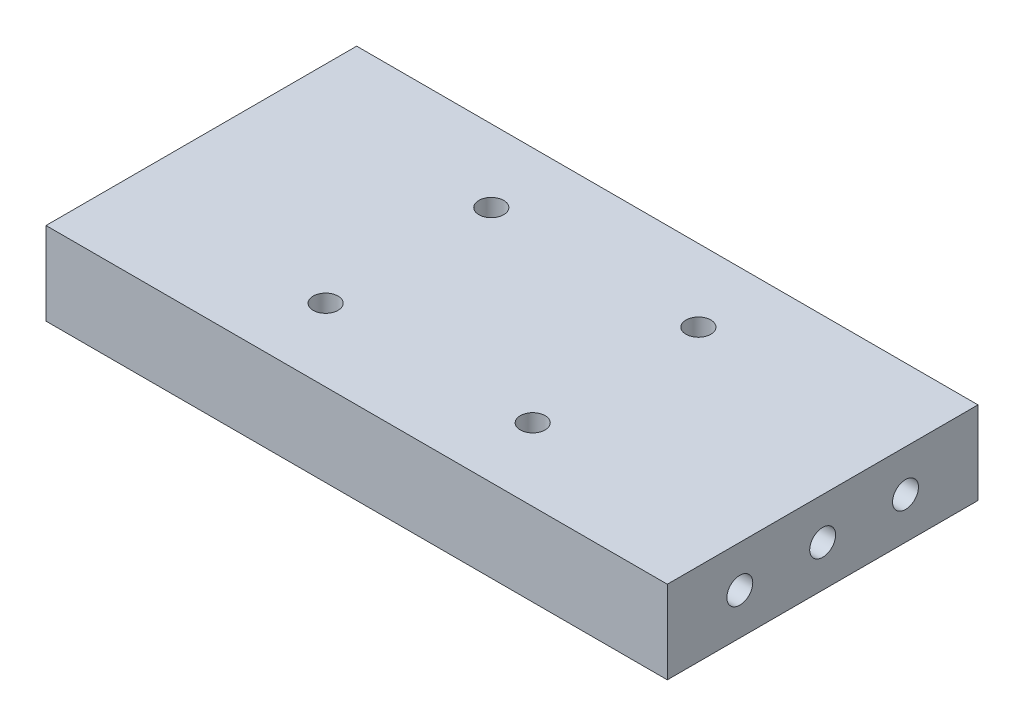
ISO-10303-21;
HEADER;
FILE_DESCRIPTION(('STEP AP214'),'2;1');
FILE_NAME('part.step','',(''),(''),'','','');
FILE_SCHEMA(('AUTOMOTIVE_DESIGN { 1 0 10303 214 1 1 1 1 }'));
ENDSEC;
DATA;
#1=APPLICATION_CONTEXT('core data for automotive mechanical design processes');
#2=APPLICATION_PROTOCOL_DEFINITION('international standard','automotive_design',2000,#1);
#3=PRODUCT_CONTEXT('',#1,'mechanical');
#4=PRODUCT('Part','Part','',(#3));
#5=PRODUCT_RELATED_PRODUCT_CATEGORY('part','',(#4));
#6=PRODUCT_DEFINITION_FORMATION('','',#4);
#7=PRODUCT_DEFINITION_CONTEXT('part definition',#1,'design');
#8=PRODUCT_DEFINITION('design','',#6,#7);
#9=PRODUCT_DEFINITION_SHAPE('','',#8);
#10=(LENGTH_UNIT() NAMED_UNIT(*) SI_UNIT(.MILLI.,.METRE.));
#11=(NAMED_UNIT(*) PLANE_ANGLE_UNIT() SI_UNIT($,.RADIAN.));
#12=(NAMED_UNIT(*) SI_UNIT($,.STERADIAN.) SOLID_ANGLE_UNIT());
#13=UNCERTAINTY_MEASURE_WITH_UNIT(LENGTH_MEASURE(1.E-05),#10,'distance_accuracy_value','');
#14=(GEOMETRIC_REPRESENTATION_CONTEXT(3) GLOBAL_UNCERTAINTY_ASSIGNED_CONTEXT((#13)) GLOBAL_UNIT_ASSIGNED_CONTEXT((#10,
#11,#12)) REPRESENTATION_CONTEXT('',''));
#15=CARTESIAN_POINT('',(0.,0.,0.));
#16=DIRECTION('',(0.,0.,1.));
#17=DIRECTION('',(1.,0.,0.));
#18=AXIS2_PLACEMENT_3D('',#15,#16,#17);
#19=CARTESIAN_POINT('',(30.,8.,-15.));
#20=DIRECTION('',(-1.,0.,0.));
#21=DIRECTION('',(0.,0.,1.));
#22=AXIS2_PLACEMENT_3D('',#19,#20,#21);
#23=PLANE('',#22);
#24=CARTESIAN_POINT('',(30.,4.,8.));
#25=DIRECTION('',(1.,0.,0.));
#26=DIRECTION('',(0.,0.,-1.));
#27=AXIS2_PLACEMENT_3D('',#24,#25,#26);
#28=CIRCLE('',#27,1.24999999999999);
#29=CARTESIAN_POINT('',(30.,4.,6.75000000000001));
#30=VERTEX_POINT('',#29);
#31=EDGE_CURVE('E114',#30,#30,#28,.T.);
#32=ORIENTED_EDGE('',*,*,#31,.F.);
#33=EDGE_LOOP('',(#32));
#34=FACE_BOUND('',#33,.T.);
#35=CARTESIAN_POINT('',(30.,4.,0.));
#36=DIRECTION('',(1.,0.,0.));
#37=DIRECTION('',(0.,0.,-1.));
#38=AXIS2_PLACEMENT_3D('',#35,#36,#37);
#39=CIRCLE('',#38,1.24999999999999);
#40=CARTESIAN_POINT('',(30.,4.,-1.24999999999999));
#41=VERTEX_POINT('',#40);
#42=EDGE_CURVE('E113',#41,#41,#39,.T.);
#43=ORIENTED_EDGE('',*,*,#42,.F.);
#44=EDGE_LOOP('',(#43));
#45=FACE_BOUND('',#44,.T.);
#46=CARTESIAN_POINT('',(30.,4.,-8.));
#47=DIRECTION('',(1.,0.,0.));
#48=DIRECTION('',(0.,0.,-1.));
#49=AXIS2_PLACEMENT_3D('',#46,#47,#48);
#50=CIRCLE('',#49,1.24999999999999);
#51=CARTESIAN_POINT('',(30.,4.,-9.24999999999999));
#52=VERTEX_POINT('',#51);
#53=EDGE_CURVE('E124',#52,#52,#50,.T.);
#54=ORIENTED_EDGE('',*,*,#53,.F.);
#55=EDGE_LOOP('',(#54));
#56=FACE_BOUND('',#55,.T.);
#57=DIRECTION('',(0.,0.,-1.));
#58=VECTOR('',#57,1.);
#59=CARTESIAN_POINT('',(30.,0.,-15.));
#60=LINE('',#59,#58);
#61=CARTESIAN_POINT('',(30.,0.,15.));
#62=VERTEX_POINT('',#61);
#63=CARTESIAN_POINT('',(30.,0.,-15.));
#64=VERTEX_POINT('',#63);
#65=EDGE_CURVE('E172',#62,#64,#60,.T.);
#66=ORIENTED_EDGE('',*,*,#65,.T.);
#67=DIRECTION('',(0.,-1.,0.));
#68=VECTOR('',#67,1.);
#69=CARTESIAN_POINT('',(30.,8.,-15.));
#70=LINE('',#69,#68);
#71=CARTESIAN_POINT('',(30.,8.,-15.));
#72=VERTEX_POINT('',#71);
#73=EDGE_CURVE('E11',#72,#64,#70,.T.);
#74=ORIENTED_EDGE('',*,*,#73,.F.);
#75=DIRECTION('',(0.,0.,-1.));
#76=VECTOR('',#75,1.);
#77=CARTESIAN_POINT('',(30.,8.,-15.));
#78=LINE('',#77,#76);
#79=CARTESIAN_POINT('',(30.,8.,15.));
#80=VERTEX_POINT('',#79);
#81=EDGE_CURVE('E173',#80,#72,#78,.T.);
#82=ORIENTED_EDGE('',*,*,#81,.F.);
#83=DIRECTION('',(0.,-1.,0.));
#84=VECTOR('',#83,1.);
#85=CARTESIAN_POINT('',(30.,8.,15.));
#86=LINE('',#85,#84);
#87=EDGE_CURVE('E179',#80,#62,#86,.T.);
#88=ORIENTED_EDGE('',*,*,#87,.T.);
#89=EDGE_LOOP('',(#66,#74,#82,#88));
#90=FACE_BOUND('',#89,.T.);
#91=ADVANCED_FACE('F37',(#34,#45,#56,#90),#23,.F.);
#92=CARTESIAN_POINT('',(-30.,8.,-15.));
#93=DIRECTION('',(0.,0.,1.));
#94=DIRECTION('',(1.,0.,0.));
#95=AXIS2_PLACEMENT_3D('',#92,#93,#94);
#96=PLANE('',#95);
#97=DIRECTION('',(-1.,0.,0.));
#98=VECTOR('',#97,1.);
#99=CARTESIAN_POINT('',(-30.,0.,-15.));
#100=LINE('',#99,#98);
#101=CARTESIAN_POINT('',(-30.,0.,-15.));
#102=VERTEX_POINT('',#101);
#103=EDGE_CURVE('E182',#64,#102,#100,.T.);
#104=ORIENTED_EDGE('',*,*,#103,.T.);
#105=DIRECTION('',(0.,-1.,0.));
#106=VECTOR('',#105,1.);
#107=CARTESIAN_POINT('',(-30.,8.,-15.));
#108=LINE('',#107,#106);
#109=CARTESIAN_POINT('',(-30.,8.,-15.));
#110=VERTEX_POINT('',#109);
#111=EDGE_CURVE('E45',#110,#102,#108,.T.);
#112=ORIENTED_EDGE('',*,*,#111,.F.);
#113=DIRECTION('',(-1.,0.,0.));
#114=VECTOR('',#113,1.);
#115=CARTESIAN_POINT('',(-30.,8.,-15.));
#116=LINE('',#115,#114);
#117=EDGE_CURVE('E84',#72,#110,#116,.T.);
#118=ORIENTED_EDGE('',*,*,#117,.F.);
#119=ORIENTED_EDGE('',*,*,#73,.T.);
#120=EDGE_LOOP('',(#104,#112,#118,#119));
#121=FACE_BOUND('',#120,.T.);
#122=ADVANCED_FACE('F206',(#121),#96,.F.);
#123=CARTESIAN_POINT('',(-30.,8.,-15.));
#124=DIRECTION('',(1.,0.,0.));
#125=DIRECTION('',(0.,0.,-1.));
#126=AXIS2_PLACEMENT_3D('',#123,#124,#125);
#127=PLANE('',#126);
#128=CARTESIAN_POINT('',(-30.,4.,-8.));
#129=DIRECTION('',(-1.,0.,0.));
#130=DIRECTION('',(0.,0.,1.));
#131=AXIS2_PLACEMENT_3D('',#128,#129,#130);
#132=CIRCLE('',#131,1.25);
#133=CARTESIAN_POINT('',(-30.,4.,-6.75));
#134=VERTEX_POINT('',#133);
#135=EDGE_CURVE('E130',#134,#134,#132,.T.);
#136=ORIENTED_EDGE('',*,*,#135,.F.);
#137=EDGE_LOOP('',(#136));
#138=FACE_BOUND('',#137,.T.);
#139=CARTESIAN_POINT('',(-30.,4.,0.));
#140=DIRECTION('',(-1.,0.,0.));
#141=DIRECTION('',(0.,0.,1.));
#142=AXIS2_PLACEMENT_3D('',#139,#140,#141);
#143=CIRCLE('',#142,1.25);
#144=CARTESIAN_POINT('',(-30.,4.,1.25));
#145=VERTEX_POINT('',#144);
#146=EDGE_CURVE('E136',#145,#145,#143,.T.);
#147=ORIENTED_EDGE('',*,*,#146,.F.);
#148=EDGE_LOOP('',(#147));
#149=FACE_BOUND('',#148,.T.);
#150=CARTESIAN_POINT('',(-30.,4.,8.));
#151=DIRECTION('',(-1.,0.,0.));
#152=DIRECTION('',(0.,0.,1.));
#153=AXIS2_PLACEMENT_3D('',#150,#151,#152);
#154=CIRCLE('',#153,1.25);
#155=CARTESIAN_POINT('',(-30.,4.,9.25));
#156=VERTEX_POINT('',#155);
#157=EDGE_CURVE('E142',#156,#156,#154,.T.);
#158=ORIENTED_EDGE('',*,*,#157,.F.);
#159=EDGE_LOOP('',(#158));
#160=FACE_BOUND('',#159,.T.);
#161=DIRECTION('',(0.,0.,1.));
#162=VECTOR('',#161,1.);
#163=CARTESIAN_POINT('',(-30.,0.,-15.));
#164=LINE('',#163,#162);
#165=CARTESIAN_POINT('',(-30.,0.,15.));
#166=VERTEX_POINT('',#165);
#167=EDGE_CURVE('E71',#102,#166,#164,.T.);
#168=ORIENTED_EDGE('',*,*,#167,.T.);
#169=DIRECTION('',(0.,-1.,0.));
#170=VECTOR('',#169,1.);
#171=CARTESIAN_POINT('',(-30.,8.,15.));
#172=LINE('',#171,#170);
#173=CARTESIAN_POINT('',(-30.,8.,15.));
#174=VERTEX_POINT('',#173);
#175=EDGE_CURVE('E187',#174,#166,#172,.T.);
#176=ORIENTED_EDGE('',*,*,#175,.F.);
#177=DIRECTION('',(0.,0.,1.));
#178=VECTOR('',#177,1.);
#179=CARTESIAN_POINT('',(-30.,8.,-15.));
#180=LINE('',#179,#178);
#181=EDGE_CURVE('E176',#110,#174,#180,.T.);
#182=ORIENTED_EDGE('',*,*,#181,.F.);
#183=ORIENTED_EDGE('',*,*,#111,.T.);
#184=EDGE_LOOP('',(#168,#176,#182,#183));
#185=FACE_BOUND('',#184,.T.);
#186=ADVANCED_FACE('F189',(#138,#149,#160,#185),#127,.F.);
#187=CARTESIAN_POINT('',(-30.,8.,15.));
#188=DIRECTION('',(0.,0.,-1.));
#189=DIRECTION('',(-1.,0.,0.));
#190=AXIS2_PLACEMENT_3D('',#187,#188,#189);
#191=PLANE('',#190);
#192=DIRECTION('',(1.,0.,0.));
#193=VECTOR('',#192,1.);
#194=CARTESIAN_POINT('',(-30.,0.,15.));
#195=LINE('',#194,#193);
#196=EDGE_CURVE('E77',#166,#62,#195,.T.);
#197=ORIENTED_EDGE('',*,*,#196,.T.);
#198=ORIENTED_EDGE('',*,*,#87,.F.);
#199=DIRECTION('',(1.,0.,0.));
#200=VECTOR('',#199,1.);
#201=CARTESIAN_POINT('',(-30.,8.,15.));
#202=LINE('',#201,#200);
#203=EDGE_CURVE('E53',#174,#80,#202,.T.);
#204=ORIENTED_EDGE('',*,*,#203,.F.);
#205=ORIENTED_EDGE('',*,*,#175,.T.);
#206=EDGE_LOOP('',(#197,#198,#204,#205));
#207=FACE_BOUND('',#206,.T.);
#208=ADVANCED_FACE('F196',(#207),#191,.F.);
#209=CARTESIAN_POINT('',(0.,8.,0.));
#210=DIRECTION('',(0.,1.,0.));
#211=DIRECTION('',(0.,0.,1.));
#212=AXIS2_PLACEMENT_3D('',#209,#210,#211);
#213=PLANE('',#212);
#214=CARTESIAN_POINT('',(-10.,8.,8.));
#215=DIRECTION('',(0.,1.,0.));
#216=DIRECTION('',(0.,0.,-1.));
#217=AXIS2_PLACEMENT_3D('',#214,#215,#216);
#218=CIRCLE('',#217,1.2);
#219=CARTESIAN_POINT('',(-10.,8.,6.8));
#220=VERTEX_POINT('',#219);
#221=EDGE_CURVE('E148',#220,#220,#218,.T.);
#222=ORIENTED_EDGE('',*,*,#221,.F.);
#223=EDGE_LOOP('',(#222));
#224=FACE_BOUND('',#223,.T.);
#225=CARTESIAN_POINT('',(10.,8.,8.));
#226=DIRECTION('',(0.,1.,0.));
#227=DIRECTION('',(0.,0.,1.));
#228=AXIS2_PLACEMENT_3D('',#225,#226,#227);
#229=CIRCLE('',#228,1.2);
#230=CARTESIAN_POINT('',(10.,8.,9.2));
#231=VERTEX_POINT('',#230);
#232=EDGE_CURVE('E157',#231,#231,#229,.T.);
#233=ORIENTED_EDGE('',*,*,#232,.F.);
#234=EDGE_LOOP('',(#233));
#235=FACE_BOUND('',#234,.T.);
#236=CARTESIAN_POINT('',(10.,8.,-8.));
#237=DIRECTION('',(0.,1.,0.));
#238=DIRECTION('',(0.,0.,-1.));
#239=AXIS2_PLACEMENT_3D('',#236,#237,#238);
#240=CIRCLE('',#239,1.2);
#241=CARTESIAN_POINT('',(10.,8.,-9.2));
#242=VERTEX_POINT('',#241);
#243=EDGE_CURVE('E149',#242,#242,#240,.T.);
#244=ORIENTED_EDGE('',*,*,#243,.F.);
#245=EDGE_LOOP('',(#244));
#246=FACE_BOUND('',#245,.T.);
#247=CARTESIAN_POINT('',(-10.,8.,-8.));
#248=DIRECTION('',(0.,1.,0.));
#249=DIRECTION('',(0.,0.,1.));
#250=AXIS2_PLACEMENT_3D('',#247,#248,#249);
#251=CIRCLE('',#250,1.2);
#252=CARTESIAN_POINT('',(-10.,8.,-6.8));
#253=VERTEX_POINT('',#252);
#254=EDGE_CURVE('E156',#253,#253,#251,.T.);
#255=ORIENTED_EDGE('',*,*,#254,.F.);
#256=EDGE_LOOP('',(#255));
#257=FACE_BOUND('',#256,.T.);
#258=ORIENTED_EDGE('',*,*,#81,.T.);
#259=ORIENTED_EDGE('',*,*,#117,.T.);
#260=ORIENTED_EDGE('',*,*,#181,.T.);
#261=ORIENTED_EDGE('',*,*,#203,.T.);
#262=EDGE_LOOP('',(#258,#259,#260,#261));
#263=FACE_BOUND('',#262,.T.);
#264=ADVANCED_FACE('F198',(#224,#235,#246,#257,#263),#213,.T.);
#265=CARTESIAN_POINT('',(0.,0.,0.));
#266=DIRECTION('',(0.,1.,0.));
#267=DIRECTION('',(0.,0.,1.));
#268=AXIS2_PLACEMENT_3D('',#265,#266,#267);
#269=PLANE('',#268);
#270=CARTESIAN_POINT('',(-10.,0.,8.));
#271=DIRECTION('',(0.,1.,0.));
#272=DIRECTION('',(0.,0.,1.));
#273=AXIS2_PLACEMENT_3D('',#270,#271,#272);
#274=CIRCLE('',#273,1.2);
#275=CARTESIAN_POINT('',(-10.,0.,9.2));
#276=VERTEX_POINT('',#275);
#277=EDGE_CURVE('E160',#276,#276,#274,.F.);
#278=ORIENTED_EDGE('',*,*,#277,.F.);
#279=EDGE_LOOP('',(#278));
#280=FACE_BOUND('',#279,.T.);
#281=CARTESIAN_POINT('',(10.,0.,8.));
#282=DIRECTION('',(0.,1.,0.));
#283=DIRECTION('',(0.,0.,1.));
#284=AXIS2_PLACEMENT_3D('',#281,#282,#283);
#285=CIRCLE('',#284,1.2);
#286=CARTESIAN_POINT('',(10.,0.,9.2));
#287=VERTEX_POINT('',#286);
#288=EDGE_CURVE('E153',#287,#287,#285,.F.);
#289=ORIENTED_EDGE('',*,*,#288,.F.);
#290=EDGE_LOOP('',(#289));
#291=FACE_BOUND('',#290,.T.);
#292=CARTESIAN_POINT('',(10.,0.,-8.));
#293=DIRECTION('',(0.,1.,0.));
#294=DIRECTION('',(0.,0.,1.));
#295=AXIS2_PLACEMENT_3D('',#292,#293,#294);
#296=CIRCLE('',#295,1.2);
#297=CARTESIAN_POINT('',(10.,0.,-6.8));
#298=VERTEX_POINT('',#297);
#299=EDGE_CURVE('E152',#298,#298,#296,.F.);
#300=ORIENTED_EDGE('',*,*,#299,.F.);
#301=EDGE_LOOP('',(#300));
#302=FACE_BOUND('',#301,.T.);
#303=CARTESIAN_POINT('',(-10.,0.,-8.));
#304=DIRECTION('',(0.,1.,0.));
#305=DIRECTION('',(0.,0.,1.));
#306=AXIS2_PLACEMENT_3D('',#303,#304,#305);
#307=CIRCLE('',#306,1.2);
#308=CARTESIAN_POINT('',(-10.,0.,-6.8));
#309=VERTEX_POINT('',#308);
#310=EDGE_CURVE('E169',#309,#309,#307,.F.);
#311=ORIENTED_EDGE('',*,*,#310,.F.);
#312=EDGE_LOOP('',(#311));
#313=FACE_BOUND('',#312,.T.);
#314=ORIENTED_EDGE('',*,*,#65,.F.);
#315=ORIENTED_EDGE('',*,*,#196,.F.);
#316=ORIENTED_EDGE('',*,*,#167,.F.);
#317=ORIENTED_EDGE('',*,*,#103,.F.);
#318=EDGE_LOOP('',(#314,#315,#316,#317));
#319=FACE_BOUND('',#318,.T.);
#320=ADVANCED_FACE('F192',(#280,#291,#302,#313,#319),#269,.F.);
#321=CARTESIAN_POINT('',(-10.,-0.000999999999999265,-8.));
#322=DIRECTION('',(0.,1.,0.));
#323=DIRECTION('',(0.,0.,1.));
#324=AXIS2_PLACEMENT_3D('',#321,#322,#323);
#325=CYLINDRICAL_SURFACE('',#324,1.2);
#326=ORIENTED_EDGE('',*,*,#254,.T.);
#327=EDGE_LOOP('',(#326));
#328=FACE_BOUND('',#327,.T.);
#329=ORIENTED_EDGE('',*,*,#310,.T.);
#330=EDGE_LOOP('',(#329));
#331=FACE_BOUND('',#330,.T.);
#332=ADVANCED_FACE('F267',(#328,#331),#325,.F.);
#333=CARTESIAN_POINT('',(10.,-0.000999999999999265,-8.));
#334=DIRECTION('',(0.,1.,0.));
#335=DIRECTION('',(0.,0.,1.));
#336=AXIS2_PLACEMENT_3D('',#333,#334,#335);
#337=CYLINDRICAL_SURFACE('',#336,1.2);
#338=ORIENTED_EDGE('',*,*,#243,.T.);
#339=EDGE_LOOP('',(#338));
#340=FACE_BOUND('',#339,.T.);
#341=ORIENTED_EDGE('',*,*,#299,.T.);
#342=EDGE_LOOP('',(#341));
#343=FACE_BOUND('',#342,.T.);
#344=ADVANCED_FACE('F263',(#340,#343),#337,.F.);
#345=CARTESIAN_POINT('',(10.,-0.000999999999999265,8.));
#346=DIRECTION('',(0.,1.,0.));
#347=DIRECTION('',(0.,0.,1.));
#348=AXIS2_PLACEMENT_3D('',#345,#346,#347);
#349=CYLINDRICAL_SURFACE('',#348,1.2);
#350=ORIENTED_EDGE('',*,*,#232,.T.);
#351=EDGE_LOOP('',(#350));
#352=FACE_BOUND('',#351,.T.);
#353=ORIENTED_EDGE('',*,*,#288,.T.);
#354=EDGE_LOOP('',(#353));
#355=FACE_BOUND('',#354,.T.);
#356=ADVANCED_FACE('F266',(#352,#355),#349,.F.);
#357=CARTESIAN_POINT('',(-10.,-0.000999999999999265,8.));
#358=DIRECTION('',(0.,1.,0.));
#359=DIRECTION('',(0.,0.,1.));
#360=AXIS2_PLACEMENT_3D('',#357,#358,#359);
#361=CYLINDRICAL_SURFACE('',#360,1.2);
#362=ORIENTED_EDGE('',*,*,#221,.T.);
#363=EDGE_LOOP('',(#362));
#364=FACE_BOUND('',#363,.T.);
#365=ORIENTED_EDGE('',*,*,#277,.T.);
#366=EDGE_LOOP('',(#365));
#367=FACE_BOUND('',#366,.T.);
#368=ADVANCED_FACE('F261',(#364,#367),#361,.F.);
#369=CARTESIAN_POINT('',(-21.5,4.,8.));
#370=DIRECTION('',(-1.,0.,0.));
#371=DIRECTION('',(0.,0.,1.));
#372=AXIS2_PLACEMENT_3D('',#369,#370,#371);
#373=CONICAL_SURFACE('',#372,1.25,1.02974425867665);
#374=CARTESIAN_POINT('',(-20.7489242262156,4.,8.));
#375=VERTEX_POINT('',#374);
#376=VERTEX_LOOP('',#375);
#377=FACE_BOUND('',#376,.T.);
#378=CARTESIAN_POINT('',(-21.5,4.,8.));
#379=DIRECTION('',(-1.,0.,0.));
#380=DIRECTION('',(0.,0.,1.));
#381=AXIS2_PLACEMENT_3D('',#378,#379,#380);
#382=CIRCLE('',#381,1.25);
#383=CARTESIAN_POINT('',(-21.5,4.,9.25));
#384=VERTEX_POINT('',#383);
#385=EDGE_CURVE('E145',#384,#384,#382,.T.);
#386=ORIENTED_EDGE('',*,*,#385,.T.);
#387=EDGE_LOOP('',(#386));
#388=FACE_BOUND('',#387,.T.);
#389=ADVANCED_FACE('F257',(#377,#388),#373,.F.);
#390=CARTESIAN_POINT('',(-30.,4.,8.));
#391=DIRECTION('',(-1.,0.,0.));
#392=DIRECTION('',(0.,0.,1.));
#393=AXIS2_PLACEMENT_3D('',#390,#391,#392);
#394=CYLINDRICAL_SURFACE('',#393,1.25);
#395=ORIENTED_EDGE('',*,*,#385,.F.);
#396=EDGE_LOOP('',(#395));
#397=FACE_BOUND('',#396,.T.);
#398=ORIENTED_EDGE('',*,*,#157,.T.);
#399=EDGE_LOOP('',(#398));
#400=FACE_BOUND('',#399,.T.);
#401=ADVANCED_FACE('F253',(#397,#400),#394,.F.);
#402=CARTESIAN_POINT('',(-21.5,4.,0.));
#403=DIRECTION('',(-1.,0.,0.));
#404=DIRECTION('',(0.,0.,1.));
#405=AXIS2_PLACEMENT_3D('',#402,#403,#404);
#406=CONICAL_SURFACE('',#405,1.25,1.02974425867665);
#407=CARTESIAN_POINT('',(-20.7489242262156,4.,0.));
#408=VERTEX_POINT('',#407);
#409=VERTEX_LOOP('',#408);
#410=FACE_BOUND('',#409,.T.);
#411=CARTESIAN_POINT('',(-21.5,4.,0.));
#412=DIRECTION('',(-1.,0.,0.));
#413=DIRECTION('',(0.,0.,1.));
#414=AXIS2_PLACEMENT_3D('',#411,#412,#413);
#415=CIRCLE('',#414,1.25);
#416=CARTESIAN_POINT('',(-21.5,4.,1.25));
#417=VERTEX_POINT('',#416);
#418=EDGE_CURVE('E139',#417,#417,#415,.T.);
#419=ORIENTED_EDGE('',*,*,#418,.T.);
#420=EDGE_LOOP('',(#419));
#421=FACE_BOUND('',#420,.T.);
#422=ADVANCED_FACE('F249',(#410,#421),#406,.F.);
#423=CARTESIAN_POINT('',(-30.,4.,0.));
#424=DIRECTION('',(-1.,0.,0.));
#425=DIRECTION('',(0.,0.,1.));
#426=AXIS2_PLACEMENT_3D('',#423,#424,#425);
#427=CYLINDRICAL_SURFACE('',#426,1.25);
#428=ORIENTED_EDGE('',*,*,#418,.F.);
#429=EDGE_LOOP('',(#428));
#430=FACE_BOUND('',#429,.T.);
#431=ORIENTED_EDGE('',*,*,#146,.T.);
#432=EDGE_LOOP('',(#431));
#433=FACE_BOUND('',#432,.T.);
#434=ADVANCED_FACE('F245',(#430,#433),#427,.F.);
#435=CARTESIAN_POINT('',(-21.5,4.,-8.));
#436=DIRECTION('',(-1.,0.,0.));
#437=DIRECTION('',(0.,0.,1.));
#438=AXIS2_PLACEMENT_3D('',#435,#436,#437);
#439=CONICAL_SURFACE('',#438,1.25,1.02974425867665);
#440=CARTESIAN_POINT('',(-20.7489242262156,4.,-8.));
#441=VERTEX_POINT('',#440);
#442=VERTEX_LOOP('',#441);
#443=FACE_BOUND('',#442,.T.);
#444=CARTESIAN_POINT('',(-21.5,4.,-8.));
#445=DIRECTION('',(-1.,0.,0.));
#446=DIRECTION('',(0.,0.,1.));
#447=AXIS2_PLACEMENT_3D('',#444,#445,#446);
#448=CIRCLE('',#447,1.25);
#449=CARTESIAN_POINT('',(-21.5,4.,-6.75));
#450=VERTEX_POINT('',#449);
#451=EDGE_CURVE('E133',#450,#450,#448,.T.);
#452=ORIENTED_EDGE('',*,*,#451,.T.);
#453=EDGE_LOOP('',(#452));
#454=FACE_BOUND('',#453,.T.);
#455=ADVANCED_FACE('F241',(#443,#454),#439,.F.);
#456=CARTESIAN_POINT('',(-30.,4.,-8.));
#457=DIRECTION('',(-1.,0.,0.));
#458=DIRECTION('',(0.,0.,1.));
#459=AXIS2_PLACEMENT_3D('',#456,#457,#458);
#460=CYLINDRICAL_SURFACE('',#459,1.25);
#461=ORIENTED_EDGE('',*,*,#451,.F.);
#462=EDGE_LOOP('',(#461));
#463=FACE_BOUND('',#462,.T.);
#464=ORIENTED_EDGE('',*,*,#135,.T.);
#465=EDGE_LOOP('',(#464));
#466=FACE_BOUND('',#465,.T.);
#467=ADVANCED_FACE('F233',(#463,#466),#460,.F.);
#468=CARTESIAN_POINT('',(21.5,4.,-8.));
#469=DIRECTION('',(1.,0.,0.));
#470=DIRECTION('',(0.,0.,-1.));
#471=AXIS2_PLACEMENT_3D('',#468,#469,#470);
#472=CONICAL_SURFACE('',#471,1.25,1.02974425867665);
#473=CARTESIAN_POINT('',(20.7489242262155,4.,-8.));
#474=VERTEX_POINT('',#473);
#475=VERTEX_LOOP('',#474);
#476=FACE_BOUND('',#475,.T.);
#477=CARTESIAN_POINT('',(21.5,4.,-8.));
#478=DIRECTION('',(1.,0.,0.));
#479=DIRECTION('',(0.,0.,-1.));
#480=AXIS2_PLACEMENT_3D('',#477,#478,#479);
#481=CIRCLE('',#480,1.25);
#482=CARTESIAN_POINT('',(21.5,4.,-9.25));
#483=VERTEX_POINT('',#482);
#484=EDGE_CURVE('E127',#483,#483,#481,.T.);
#485=ORIENTED_EDGE('',*,*,#484,.T.);
#486=EDGE_LOOP('',(#485));
#487=FACE_BOUND('',#486,.T.);
#488=ADVANCED_FACE('F224',(#476,#487),#472,.F.);
#489=CARTESIAN_POINT('',(30.,4.,-8.));
#490=DIRECTION('',(1.,0.,0.));
#491=DIRECTION('',(0.,0.,-1.));
#492=AXIS2_PLACEMENT_3D('',#489,#490,#491);
#493=CYLINDRICAL_SURFACE('',#492,1.24999999999999);
#494=ORIENTED_EDGE('',*,*,#484,.F.);
#495=EDGE_LOOP('',(#494));
#496=FACE_BOUND('',#495,.T.);
#497=ORIENTED_EDGE('',*,*,#53,.T.);
#498=EDGE_LOOP('',(#497));
#499=FACE_BOUND('',#498,.T.);
#500=ADVANCED_FACE('F221',(#496,#499),#493,.F.);
#501=CARTESIAN_POINT('',(21.5,4.,0.));
#502=DIRECTION('',(1.,0.,0.));
#503=DIRECTION('',(0.,0.,-1.));
#504=AXIS2_PLACEMENT_3D('',#501,#502,#503);
#505=CONICAL_SURFACE('',#504,1.25,1.02974425867665);
#506=CARTESIAN_POINT('',(20.7489242262155,4.,0.));
#507=VERTEX_POINT('',#506);
#508=VERTEX_LOOP('',#507);
#509=FACE_BOUND('',#508,.T.);
#510=CARTESIAN_POINT('',(21.5,4.,0.));
#511=DIRECTION('',(1.,0.,0.));
#512=DIRECTION('',(0.,0.,-1.));
#513=AXIS2_PLACEMENT_3D('',#510,#511,#512);
#514=CIRCLE('',#513,1.25);
#515=CARTESIAN_POINT('',(21.5,4.,-1.25));
#516=VERTEX_POINT('',#515);
#517=EDGE_CURVE('E117',#516,#516,#514,.T.);
#518=ORIENTED_EDGE('',*,*,#517,.T.);
#519=EDGE_LOOP('',(#518));
#520=FACE_BOUND('',#519,.T.);
#521=ADVANCED_FACE('F223',(#509,#520),#505,.F.);
#522=CARTESIAN_POINT('',(30.,4.,0.));
#523=DIRECTION('',(1.,0.,0.));
#524=DIRECTION('',(0.,0.,-1.));
#525=AXIS2_PLACEMENT_3D('',#522,#523,#524);
#526=CYLINDRICAL_SURFACE('',#525,1.24999999999999);
#527=ORIENTED_EDGE('',*,*,#517,.F.);
#528=EDGE_LOOP('',(#527));
#529=FACE_BOUND('',#528,.T.);
#530=ORIENTED_EDGE('',*,*,#42,.T.);
#531=EDGE_LOOP('',(#530));
#532=FACE_BOUND('',#531,.T.);
#533=ADVANCED_FACE('F107',(#529,#532),#526,.F.);
#534=CARTESIAN_POINT('',(21.5,4.,8.));
#535=DIRECTION('',(1.,0.,0.));
#536=DIRECTION('',(0.,0.,-1.));
#537=AXIS2_PLACEMENT_3D('',#534,#535,#536);
#538=CONICAL_SURFACE('',#537,1.25,1.02974425867665);
#539=CARTESIAN_POINT('',(20.7489242262155,4.,8.));
#540=VERTEX_POINT('',#539);
#541=VERTEX_LOOP('',#540);
#542=FACE_BOUND('',#541,.T.);
#543=CARTESIAN_POINT('',(21.5,4.,8.));
#544=DIRECTION('',(1.,0.,0.));
#545=DIRECTION('',(0.,0.,-1.));
#546=AXIS2_PLACEMENT_3D('',#543,#544,#545);
#547=CIRCLE('',#546,1.25);
#548=CARTESIAN_POINT('',(21.5,4.,6.75));
#549=VERTEX_POINT('',#548);
#550=EDGE_CURVE('E111',#549,#549,#547,.T.);
#551=ORIENTED_EDGE('',*,*,#550,.T.);
#552=EDGE_LOOP('',(#551));
#553=FACE_BOUND('',#552,.T.);
#554=ADVANCED_FACE('F103',(#542,#553),#538,.F.);
#555=CARTESIAN_POINT('',(30.,4.,8.));
#556=DIRECTION('',(1.,0.,0.));
#557=DIRECTION('',(0.,0.,-1.));
#558=AXIS2_PLACEMENT_3D('',#555,#556,#557);
#559=CYLINDRICAL_SURFACE('',#558,1.24999999999999);
#560=ORIENTED_EDGE('',*,*,#550,.F.);
#561=EDGE_LOOP('',(#560));
#562=FACE_BOUND('',#561,.T.);
#563=ORIENTED_EDGE('',*,*,#31,.T.);
#564=EDGE_LOOP('',(#563));
#565=FACE_BOUND('',#564,.T.);
#566=ADVANCED_FACE('F106',(#562,#565),#559,.F.);
#567=CLOSED_SHELL('',(#91,#122,#186,#208,#264,#320,#332,#344,#356,#368,#389,#401,#422,#434,#455,
#467,#488,#500,#521,#533,#554,#566));
#568=MANIFOLD_SOLID_BREP('B2',#567);
#569=ADVANCED_BREP_SHAPE_REPRESENTATION('',(#18,#568),#14);
#570=SHAPE_DEFINITION_REPRESENTATION(#9,#569);
ENDSEC;
END-ISO-10303-21;
